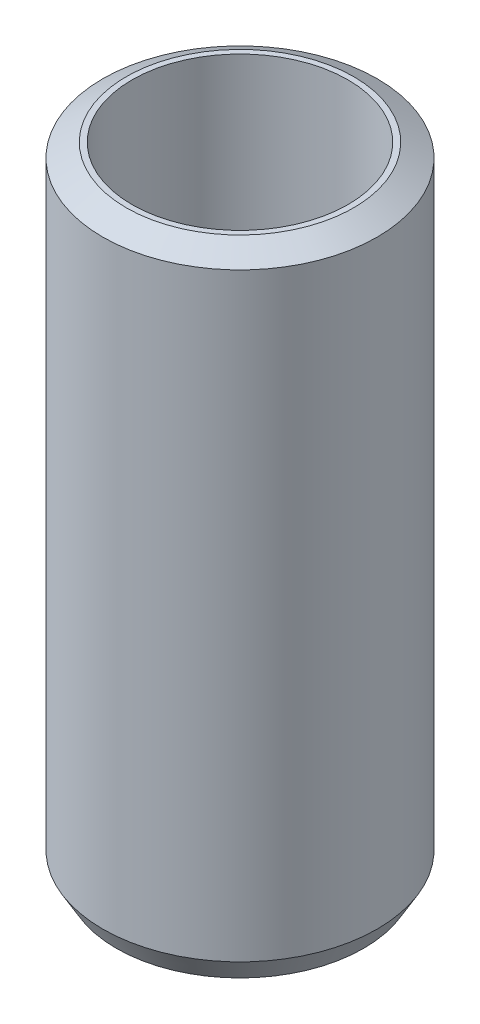
ISO-10303-21;
HEADER;
FILE_DESCRIPTION(('STEP AP214'),'2;1');
FILE_NAME('part.step','',(''),(''),'','','');
FILE_SCHEMA(('AUTOMOTIVE_DESIGN { 1 0 10303 214 1 1 1 1 }'));
ENDSEC;
DATA;
#1=APPLICATION_CONTEXT('core data for automotive mechanical design processes');
#2=APPLICATION_PROTOCOL_DEFINITION('international standard','automotive_design',2000,#1);
#3=PRODUCT_CONTEXT('',#1,'mechanical');
#4=PRODUCT('Part','Part','',(#3));
#5=PRODUCT_RELATED_PRODUCT_CATEGORY('part','',(#4));
#6=PRODUCT_DEFINITION_FORMATION('','',#4);
#7=PRODUCT_DEFINITION_CONTEXT('part definition',#1,'design');
#8=PRODUCT_DEFINITION('design','',#6,#7);
#9=PRODUCT_DEFINITION_SHAPE('','',#8);
#10=(LENGTH_UNIT() NAMED_UNIT(*) SI_UNIT(.MILLI.,.METRE.));
#11=(NAMED_UNIT(*) PLANE_ANGLE_UNIT() SI_UNIT($,.RADIAN.));
#12=(NAMED_UNIT(*) SI_UNIT($,.STERADIAN.) SOLID_ANGLE_UNIT());
#13=UNCERTAINTY_MEASURE_WITH_UNIT(LENGTH_MEASURE(1.E-05),#10,'distance_accuracy_value','');
#14=(GEOMETRIC_REPRESENTATION_CONTEXT(3) GLOBAL_UNCERTAINTY_ASSIGNED_CONTEXT((#13)) GLOBAL_UNIT_ASSIGNED_CONTEXT((#10,
#11,#12)) REPRESENTATION_CONTEXT('',''));
#15=CARTESIAN_POINT('',(0.,0.,0.));
#16=DIRECTION('',(0.,0.,1.));
#17=DIRECTION('',(1.,0.,0.));
#18=AXIS2_PLACEMENT_3D('',#15,#16,#17);
#19=CARTESIAN_POINT('',(0.,185.539007094334,0.));
#20=DIRECTION('',(0.,-1.,0.));
#21=DIRECTION('',(0.,0.,-1.));
#22=AXIS2_PLACEMENT_3D('',#19,#20,#21);
#23=CYLINDRICAL_SURFACE('',#22,40.);
#24=CARTESIAN_POINT('',(0.,181.577563551797,0.));
#25=DIRECTION('',(0.,1.,0.));
#26=DIRECTION('',(0.,0.,1.));
#27=AXIS2_PLACEMENT_3D('',#24,#25,#26);
#28=CIRCLE('',#27,40.);
#29=CARTESIAN_POINT('',(0.,181.577563551797,40.));
#30=VERTEX_POINT('',#29);
#31=EDGE_CURVE('E50',#30,#30,#28,.F.);
#32=ORIENTED_EDGE('',*,*,#31,.T.);
#33=EDGE_LOOP('',(#32));
#34=FACE_BOUND('',#33,.T.);
#35=CARTESIAN_POINT('',(0.,6.86142148699004,0.));
#36=DIRECTION('',(0.,1.,0.));
#37=DIRECTION('',(0.,0.,1.));
#38=AXIS2_PLACEMENT_3D('',#35,#36,#37);
#39=CIRCLE('',#38,40.);
#40=CARTESIAN_POINT('',(0.,6.86142148699004,40.));
#41=VERTEX_POINT('',#40);
#42=EDGE_CURVE('E51',#41,#41,#39,.T.);
#43=ORIENTED_EDGE('',*,*,#42,.T.);
#44=EDGE_LOOP('',(#43));
#45=FACE_BOUND('',#44,.T.);
#46=ADVANCED_FACE('F39',(#34,#45),#23,.T.);
#47=CARTESIAN_POINT('',(0.,185.539007094334,0.));
#48=DIRECTION('',(0.,1.,0.));
#49=DIRECTION('',(0.,0.,1.));
#50=AXIS2_PLACEMENT_3D('',#47,#48,#49);
#51=PLANE('',#50);
#52=CARTESIAN_POINT('',(0.,185.539007094334,0.));
#53=DIRECTION('',(0.,1.,0.));
#54=DIRECTION('',(0.,0.,1.));
#55=AXIS2_PLACEMENT_3D('',#52,#53,#54);
#56=CIRCLE('',#55,33.13857851301);
#57=CARTESIAN_POINT('',(0.,185.539007094334,33.13857851301));
#58=VERTEX_POINT('',#57);
#59=EDGE_CURVE('E54',#58,#58,#56,.T.);
#60=ORIENTED_EDGE('',*,*,#59,.T.);
#61=EDGE_LOOP('',(#60));
#62=FACE_BOUND('',#61,.T.);
#63=CARTESIAN_POINT('',(0.,185.539007094334,0.));
#64=DIRECTION('',(0.,1.,0.));
#65=DIRECTION('',(0.,0.,1.));
#66=AXIS2_PLACEMENT_3D('',#63,#64,#65);
#67=CIRCLE('',#66,31.4993851740567);
#68=CARTESIAN_POINT('',(0.,185.539007094334,31.4993851740567));
#69=VERTEX_POINT('',#68);
#70=EDGE_CURVE('E58',#69,#69,#67,.T.);
#71=ORIENTED_EDGE('',*,*,#70,.F.);
#72=EDGE_LOOP('',(#71));
#73=FACE_BOUND('',#72,.T.);
#74=ADVANCED_FACE('F69',(#62,#73),#51,.T.);
#75=CARTESIAN_POINT('',(0.,0.,0.));
#76=DIRECTION('',(0.,1.,0.));
#77=DIRECTION('',(0.,0.,1.));
#78=AXIS2_PLACEMENT_3D('',#75,#76,#77);
#79=PLANE('',#78);
#80=CARTESIAN_POINT('',(0.,0.,0.));
#81=DIRECTION('',(0.,1.,0.));
#82=DIRECTION('',(0.,0.,1.));
#83=AXIS2_PLACEMENT_3D('',#80,#81,#82);
#84=CIRCLE('',#83,36.0385564574628);
#85=CARTESIAN_POINT('',(0.,0.,36.0385564574628));
#86=VERTEX_POINT('',#85);
#87=EDGE_CURVE('E10',#86,#86,#84,.F.);
#88=ORIENTED_EDGE('',*,*,#87,.T.);
#89=EDGE_LOOP('',(#88));
#90=FACE_BOUND('',#89,.T.);
#91=CARTESIAN_POINT('',(0.,0.,0.));
#92=DIRECTION('',(0.,1.,0.));
#93=DIRECTION('',(0.,0.,1.));
#94=AXIS2_PLACEMENT_3D('',#91,#92,#93);
#95=CIRCLE('',#94,31.4993851740567);
#96=CARTESIAN_POINT('',(0.,0.,31.4993851740567));
#97=VERTEX_POINT('',#96);
#98=EDGE_CURVE('E63',#97,#97,#95,.T.);
#99=ORIENTED_EDGE('',*,*,#98,.T.);
#100=EDGE_LOOP('',(#99));
#101=FACE_BOUND('',#100,.T.);
#102=ADVANCED_FACE('F75',(#90,#101),#79,.F.);
#103=CARTESIAN_POINT('',(0.,185.539007094334,0.));
#104=DIRECTION('',(0.,-1.,0.));
#105=DIRECTION('',(0.,0.,-1.));
#106=AXIS2_PLACEMENT_3D('',#103,#104,#105);
#107=CYLINDRICAL_SURFACE('',#106,31.4993851740567);
#108=ORIENTED_EDGE('',*,*,#70,.T.);
#109=EDGE_LOOP('',(#108));
#110=FACE_BOUND('',#109,.T.);
#111=ORIENTED_EDGE('',*,*,#98,.F.);
#112=EDGE_LOOP('',(#111));
#113=FACE_BOUND('',#112,.T.);
#114=ADVANCED_FACE('F70',(#110,#113),#107,.F.);
#115=CARTESIAN_POINT('',(0.,185.539007094334,0.));
#116=DIRECTION('',(0.,-1.,0.));
#117=DIRECTION('',(0.,0.,-1.));
#118=AXIS2_PLACEMENT_3D('',#115,#116,#117);
#119=CONICAL_SURFACE('',#118,33.13857851301,1.0471975511966);
#120=ORIENTED_EDGE('',*,*,#31,.F.);
#121=EDGE_LOOP('',(#120));
#122=FACE_BOUND('',#121,.T.);
#123=ORIENTED_EDGE('',*,*,#59,.F.);
#124=EDGE_LOOP('',(#123));
#125=FACE_BOUND('',#124,.T.);
#126=ADVANCED_FACE('F81',(#122,#125),#119,.T.);
#127=CARTESIAN_POINT('',(0.,6.86142148699004,0.));
#128=DIRECTION('',(0.,1.,0.));
#129=DIRECTION('',(0.,0.,1.));
#130=AXIS2_PLACEMENT_3D('',#127,#128,#129);
#131=CONICAL_SURFACE('',#130,40.,0.523598775598304);
#132=ORIENTED_EDGE('',*,*,#87,.F.);
#133=EDGE_LOOP('',(#132));
#134=FACE_BOUND('',#133,.T.);
#135=ORIENTED_EDGE('',*,*,#42,.F.);
#136=EDGE_LOOP('',(#135));
#137=FACE_BOUND('',#136,.T.);
#138=ADVANCED_FACE('F45',(#134,#137),#131,.T.);
#139=CLOSED_SHELL('',(#46,#74,#102,#114,#126,#138));
#140=MANIFOLD_SOLID_BREP('B2',#139);
#141=ADVANCED_BREP_SHAPE_REPRESENTATION('',(#18,#140),#14);
#142=SHAPE_DEFINITION_REPRESENTATION(#9,#141);
ENDSEC;
END-ISO-10303-21;
